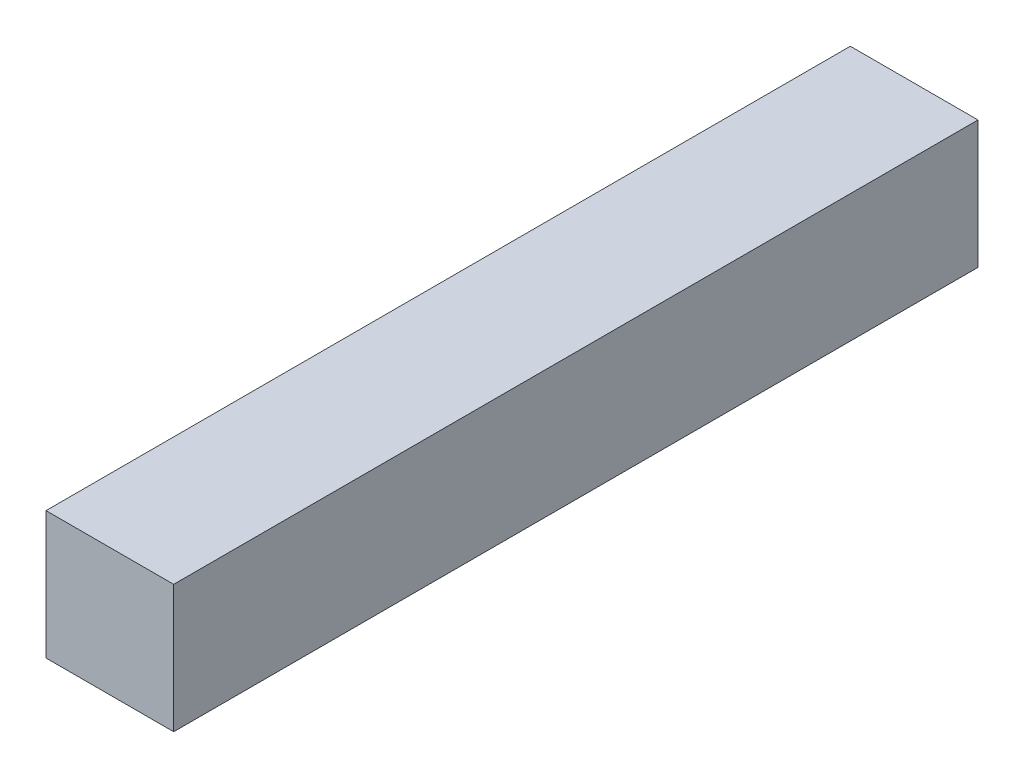
ISO-10303-21;
HEADER;
FILE_DESCRIPTION(('STEP AP214'),'2;1');
FILE_NAME('part.step','',(''),(''),'','','');
FILE_SCHEMA(('AUTOMOTIVE_DESIGN { 1 0 10303 214 1 1 1 1 }'));
ENDSEC;
DATA;
#1=APPLICATION_CONTEXT('core data for automotive mechanical design processes');
#2=APPLICATION_PROTOCOL_DEFINITION('international standard','automotive_design',2000,#1);
#3=PRODUCT_CONTEXT('',#1,'mechanical');
#4=PRODUCT('Part','Part','',(#3));
#5=PRODUCT_RELATED_PRODUCT_CATEGORY('part','',(#4));
#6=PRODUCT_DEFINITION_FORMATION('','',#4);
#7=PRODUCT_DEFINITION_CONTEXT('part definition',#1,'design');
#8=PRODUCT_DEFINITION('design','',#6,#7);
#9=PRODUCT_DEFINITION_SHAPE('','',#8);
#10=(LENGTH_UNIT() NAMED_UNIT(*) SI_UNIT(.MILLI.,.METRE.));
#11=(NAMED_UNIT(*) PLANE_ANGLE_UNIT() SI_UNIT($,.RADIAN.));
#12=(NAMED_UNIT(*) SI_UNIT($,.STERADIAN.) SOLID_ANGLE_UNIT());
#13=UNCERTAINTY_MEASURE_WITH_UNIT(LENGTH_MEASURE(1.E-05),#10,'distance_accuracy_value','');
#14=(GEOMETRIC_REPRESENTATION_CONTEXT(3) GLOBAL_UNCERTAINTY_ASSIGNED_CONTEXT((#13)) GLOBAL_UNIT_ASSIGNED_CONTEXT((#10,
#11,#12)) REPRESENTATION_CONTEXT('',''));
#15=CARTESIAN_POINT('',(0.,0.,0.));
#16=DIRECTION('',(0.,0.,1.));
#17=DIRECTION('',(1.,0.,0.));
#18=AXIS2_PLACEMENT_3D('',#15,#16,#17);
#19=CARTESIAN_POINT('',(1.5875,-1.5875,20.));
#20=DIRECTION('',(-1.,0.,0.));
#21=DIRECTION('',(0.,0.,1.));
#22=AXIS2_PLACEMENT_3D('',#19,#20,#21);
#23=PLANE('',#22);
#24=DIRECTION('',(0.,1.,0.));
#25=VECTOR('',#24,1.);
#26=CARTESIAN_POINT('',(1.5875,-1.5875,0.));
#27=LINE('',#26,#25);
#28=CARTESIAN_POINT('',(1.5875,-1.5875,0.));
#29=VERTEX_POINT('',#28);
#30=CARTESIAN_POINT('',(1.5875,1.5875,0.));
#31=VERTEX_POINT('',#30);
#32=EDGE_CURVE('E107',#29,#31,#27,.T.);
#33=ORIENTED_EDGE('',*,*,#32,.T.);
#34=DIRECTION('',(0.,0.,-1.));
#35=VECTOR('',#34,1.);
#36=CARTESIAN_POINT('',(1.5875,1.5875,20.));
#37=LINE('',#36,#35);
#38=CARTESIAN_POINT('',(1.5875,1.5875,20.));
#39=VERTEX_POINT('',#38);
#40=EDGE_CURVE('E11',#39,#31,#37,.T.);
#41=ORIENTED_EDGE('',*,*,#40,.F.);
#42=DIRECTION('',(0.,1.,0.));
#43=VECTOR('',#42,1.);
#44=CARTESIAN_POINT('',(1.5875,-1.5875,20.));
#45=LINE('',#44,#43);
#46=CARTESIAN_POINT('',(1.5875,-1.5875,20.));
#47=VERTEX_POINT('',#46);
#48=EDGE_CURVE('E91',#47,#39,#45,.T.);
#49=ORIENTED_EDGE('',*,*,#48,.F.);
#50=DIRECTION('',(0.,0.,-1.));
#51=VECTOR('',#50,1.);
#52=CARTESIAN_POINT('',(1.5875,-1.5875,20.));
#53=LINE('',#52,#51);
#54=EDGE_CURVE('E103',#47,#29,#53,.T.);
#55=ORIENTED_EDGE('',*,*,#54,.T.);
#56=EDGE_LOOP('',(#33,#41,#49,#55));
#57=FACE_BOUND('',#56,.T.);
#58=ADVANCED_FACE('F39',(#57),#23,.F.);
#59=CARTESIAN_POINT('',(-1.5875,1.5875,20.));
#60=DIRECTION('',(0.,-1.,0.));
#61=DIRECTION('',(0.,0.,-1.));
#62=AXIS2_PLACEMENT_3D('',#59,#60,#61);
#63=PLANE('',#62);
#64=DIRECTION('',(-1.,0.,0.));
#65=VECTOR('',#64,1.);
#66=CARTESIAN_POINT('',(-1.5875,1.5875,0.));
#67=LINE('',#66,#65);
#68=CARTESIAN_POINT('',(-1.5875,1.5875,0.));
#69=VERTEX_POINT('',#68);
#70=EDGE_CURVE('E96',#31,#69,#67,.T.);
#71=ORIENTED_EDGE('',*,*,#70,.T.);
#72=DIRECTION('',(0.,0.,-1.));
#73=VECTOR('',#72,1.);
#74=CARTESIAN_POINT('',(-1.5875,1.5875,20.));
#75=LINE('',#74,#73);
#76=CARTESIAN_POINT('',(-1.5875,1.5875,20.));
#77=VERTEX_POINT('',#76);
#78=EDGE_CURVE('E48',#77,#69,#75,.T.);
#79=ORIENTED_EDGE('',*,*,#78,.F.);
#80=DIRECTION('',(-1.,0.,0.));
#81=VECTOR('',#80,1.);
#82=CARTESIAN_POINT('',(-1.5875,1.5875,20.));
#83=LINE('',#82,#81);
#84=EDGE_CURVE('E86',#39,#77,#83,.T.);
#85=ORIENTED_EDGE('',*,*,#84,.F.);
#86=ORIENTED_EDGE('',*,*,#40,.T.);
#87=EDGE_LOOP('',(#71,#79,#85,#86));
#88=FACE_BOUND('',#87,.T.);
#89=ADVANCED_FACE('F95',(#88),#63,.F.);
#90=CARTESIAN_POINT('',(-1.5875,-1.5875,20.));
#91=DIRECTION('',(1.,0.,0.));
#92=DIRECTION('',(0.,0.,-1.));
#93=AXIS2_PLACEMENT_3D('',#90,#91,#92);
#94=PLANE('',#93);
#95=DIRECTION('',(0.,-1.,0.));
#96=VECTOR('',#95,1.);
#97=CARTESIAN_POINT('',(-1.5875,-1.5875,0.));
#98=LINE('',#97,#96);
#99=CARTESIAN_POINT('',(-1.5875,-1.5875,0.));
#100=VERTEX_POINT('',#99);
#101=EDGE_CURVE('E73',#69,#100,#98,.T.);
#102=ORIENTED_EDGE('',*,*,#101,.T.);
#103=DIRECTION('',(0.,0.,-1.));
#104=VECTOR('',#103,1.);
#105=CARTESIAN_POINT('',(-1.5875,-1.5875,20.));
#106=LINE('',#105,#104);
#107=CARTESIAN_POINT('',(-1.5875,-1.5875,20.));
#108=VERTEX_POINT('',#107);
#109=EDGE_CURVE('E98',#108,#100,#106,.T.);
#110=ORIENTED_EDGE('',*,*,#109,.F.);
#111=DIRECTION('',(0.,-1.,0.));
#112=VECTOR('',#111,1.);
#113=CARTESIAN_POINT('',(-1.5875,-1.5875,20.));
#114=LINE('',#113,#112);
#115=EDGE_CURVE('E89',#77,#108,#114,.T.);
#116=ORIENTED_EDGE('',*,*,#115,.F.);
#117=ORIENTED_EDGE('',*,*,#78,.T.);
#118=EDGE_LOOP('',(#102,#110,#116,#117));
#119=FACE_BOUND('',#118,.T.);
#120=ADVANCED_FACE('F99',(#119),#94,.F.);
#121=CARTESIAN_POINT('',(-1.5875,-1.5875,20.));
#122=DIRECTION('',(0.,1.,0.));
#123=DIRECTION('',(0.,0.,1.));
#124=AXIS2_PLACEMENT_3D('',#121,#122,#123);
#125=PLANE('',#124);
#126=DIRECTION('',(1.,0.,0.));
#127=VECTOR('',#126,1.);
#128=CARTESIAN_POINT('',(-1.5875,-1.5875,0.));
#129=LINE('',#128,#127);
#130=EDGE_CURVE('E79',#100,#29,#129,.T.);
#131=ORIENTED_EDGE('',*,*,#130,.T.);
#132=ORIENTED_EDGE('',*,*,#54,.F.);
#133=DIRECTION('',(1.,0.,0.));
#134=VECTOR('',#133,1.);
#135=CARTESIAN_POINT('',(-1.5875,-1.5875,20.));
#136=LINE('',#135,#134);
#137=EDGE_CURVE('E56',#108,#47,#136,.T.);
#138=ORIENTED_EDGE('',*,*,#137,.F.);
#139=ORIENTED_EDGE('',*,*,#109,.T.);
#140=EDGE_LOOP('',(#131,#132,#138,#139));
#141=FACE_BOUND('',#140,.T.);
#142=ADVANCED_FACE('F120',(#141),#125,.F.);
#143=CARTESIAN_POINT('',(0.,0.,20.));
#144=DIRECTION('',(0.,0.,-1.));
#145=DIRECTION('',(-1.,0.,0.));
#146=AXIS2_PLACEMENT_3D('',#143,#144,#145);
#147=PLANE('',#146);
#148=ORIENTED_EDGE('',*,*,#48,.T.);
#149=ORIENTED_EDGE('',*,*,#84,.T.);
#150=ORIENTED_EDGE('',*,*,#115,.T.);
#151=ORIENTED_EDGE('',*,*,#137,.T.);
#152=EDGE_LOOP('',(#148,#149,#150,#151));
#153=FACE_BOUND('',#152,.T.);
#154=ADVANCED_FACE('F87',(#153),#147,.F.);
#155=CARTESIAN_POINT('',(0.,0.,0.));
#156=DIRECTION('',(0.,0.,-1.));
#157=DIRECTION('',(-1.,0.,0.));
#158=AXIS2_PLACEMENT_3D('',#155,#156,#157);
#159=PLANE('',#158);
#160=ORIENTED_EDGE('',*,*,#32,.F.);
#161=ORIENTED_EDGE('',*,*,#130,.F.);
#162=ORIENTED_EDGE('',*,*,#101,.F.);
#163=ORIENTED_EDGE('',*,*,#70,.F.);
#164=EDGE_LOOP('',(#160,#161,#162,#163));
#165=FACE_BOUND('',#164,.T.);
#166=ADVANCED_FACE('F123',(#165),#159,.T.);
#167=CLOSED_SHELL('',(#58,#89,#120,#142,#154,#166));
#168=MANIFOLD_SOLID_BREP('B2',#167);
#169=ADVANCED_BREP_SHAPE_REPRESENTATION('',(#18,#168),#14);
#170=SHAPE_DEFINITION_REPRESENTATION(#9,#169);
ENDSEC;
END-ISO-10303-21;
